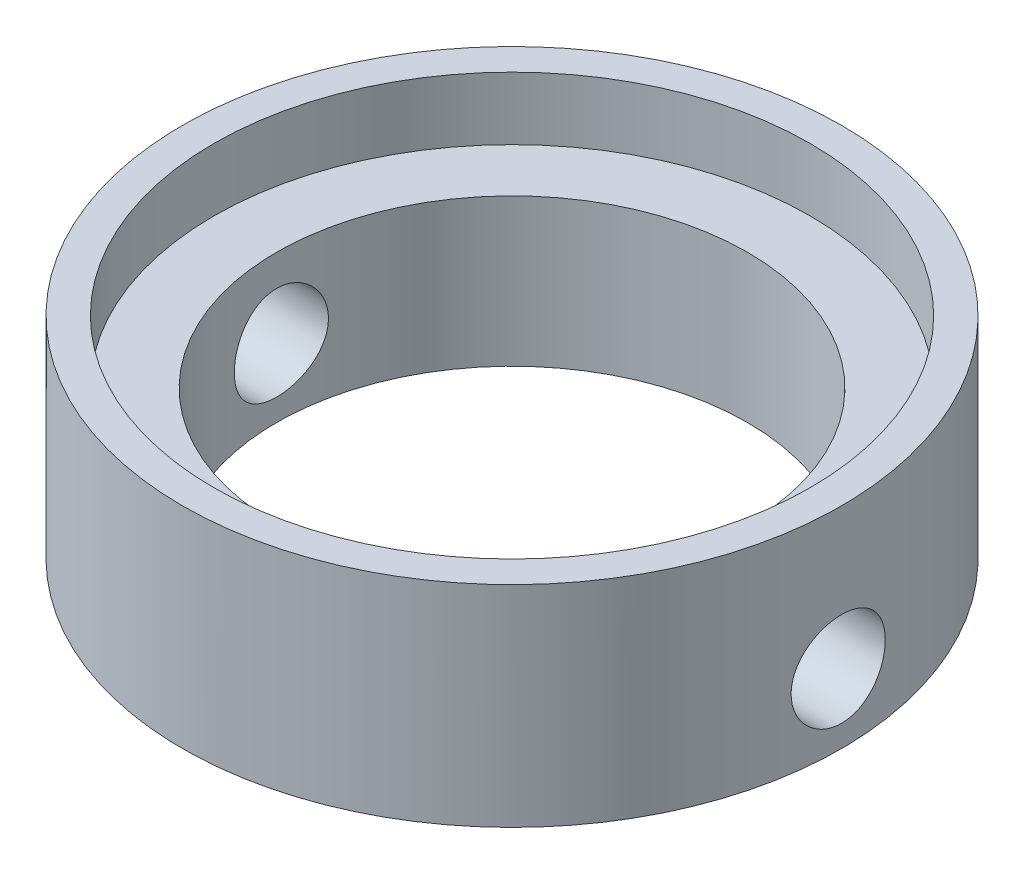
ISO-10303-21;
HEADER;
FILE_DESCRIPTION(('STEP AP214'),'2;1');
FILE_NAME('part.step','',(''),(''),'','','');
FILE_SCHEMA(('AUTOMOTIVE_DESIGN { 1 0 10303 214 1 1 1 1 }'));
ENDSEC;
DATA;
#1=APPLICATION_CONTEXT('core data for automotive mechanical design processes');
#2=APPLICATION_PROTOCOL_DEFINITION('international standard','automotive_design',2000,#1);
#3=PRODUCT_CONTEXT('',#1,'mechanical');
#4=PRODUCT('Part','Part','',(#3));
#5=PRODUCT_RELATED_PRODUCT_CATEGORY('part','',(#4));
#6=PRODUCT_DEFINITION_FORMATION('','',#4);
#7=PRODUCT_DEFINITION_CONTEXT('part definition',#1,'design');
#8=PRODUCT_DEFINITION('design','',#6,#7);
#9=PRODUCT_DEFINITION_SHAPE('','',#8);
#10=(LENGTH_UNIT() NAMED_UNIT(*) SI_UNIT(.MILLI.,.METRE.));
#11=(NAMED_UNIT(*) PLANE_ANGLE_UNIT() SI_UNIT($,.RADIAN.));
#12=(NAMED_UNIT(*) SI_UNIT($,.STERADIAN.) SOLID_ANGLE_UNIT());
#13=UNCERTAINTY_MEASURE_WITH_UNIT(LENGTH_MEASURE(1.E-05),#10,'distance_accuracy_value','');
#14=(GEOMETRIC_REPRESENTATION_CONTEXT(3) GLOBAL_UNCERTAINTY_ASSIGNED_CONTEXT((#13)) GLOBAL_UNIT_ASSIGNED_CONTEXT((#10,
#11,#12)) REPRESENTATION_CONTEXT('',''));
#15=CARTESIAN_POINT('',(0.,0.,0.));
#16=DIRECTION('',(0.,0.,1.));
#17=DIRECTION('',(1.,0.,0.));
#18=AXIS2_PLACEMENT_3D('',#15,#16,#17);
#19=CARTESIAN_POINT('',(0.,7.,0.));
#20=DIRECTION('',(0.,-1.,0.));
#21=DIRECTION('',(0.,0.,-1.));
#22=AXIS2_PLACEMENT_3D('',#19,#20,#21);
#23=CYLINDRICAL_SURFACE('',#22,10.5);
#24=CARTESIAN_POINT('',(0.,7.,0.));
#25=DIRECTION('',(0.,1.,0.));
#26=DIRECTION('',(0.,0.,1.));
#27=AXIS2_PLACEMENT_3D('',#24,#25,#26);
#28=CIRCLE('',#27,10.5);
#29=CARTESIAN_POINT('',(0.,7.,10.5));
#30=VERTEX_POINT('',#29);
#31=EDGE_CURVE('E10',#30,#30,#28,.T.);
#32=ORIENTED_EDGE('',*,*,#31,.F.);
#33=EDGE_LOOP('',(#32));
#34=FACE_BOUND('',#33,.T.);
#35=CARTESIAN_POINT('',(10.3923048454133,2.5,-1.5));
#36=CARTESIAN_POINT('',(10.3923061930305,2.41620687157653,-1.49999650587036));
#37=CARTESIAN_POINT('',(10.3933292406285,2.33236396544112,-1.49295498380541));
#38=CARTESIAN_POINT('',(10.3973084943365,2.1670190227015,-1.46498055103788));
#39=CARTESIAN_POINT('',(10.4002666268522,2.08551940336741,-1.44403379716319));
#40=CARTESIAN_POINT('',(10.4077743195951,1.92727847497168,-1.38888554127209));
#41=CARTESIAN_POINT('',(10.4123227012455,1.85053369142282,-1.35469385341522));
#42=CARTESIAN_POINT('',(10.4224969995472,1.70388270290075,-1.27404881916946));
#43=CARTESIAN_POINT('',(10.4281227569753,1.63397548972026,-1.22759728425554));
#44=CARTESIAN_POINT('',(10.4398636894,1.50246377811402,-1.12339010130137));
#45=CARTESIAN_POINT('',(10.445981808541,1.44091621460046,-1.06556292320494));
#46=CARTESIAN_POINT('',(10.4579917733928,1.32836383206969,-0.940400309225388));
#47=CARTESIAN_POINT('',(10.4638836070179,1.27735957551983,-0.873064366388353));
#48=CARTESIAN_POINT('',(10.4748077776705,1.1871331766802,-0.730432788015362));
#49=CARTESIAN_POINT('',(10.4798362672007,1.14796321411117,-0.655103824662068));
#50=CARTESIAN_POINT('',(10.4884346358971,1.08285194850414,-0.498852559472325));
#51=CARTESIAN_POINT('',(10.4920045851274,1.05691001001446,-0.417930526529498));
#52=CARTESIAN_POINT('',(10.4972628750673,1.0191630947768,-0.253375547655713));
#53=CARTESIAN_POINT('',(10.4989638773858,1.00726294752532,-0.169764843802409));
#54=CARTESIAN_POINT('',(10.5003359661287,0.997642076075051,-0.00171717395879946));
#55=CARTESIAN_POINT('',(10.5000071553917,0.999920633525417,0.0827197499554341));
#56=CARTESIAN_POINT('',(10.4973668209745,1.01851703366186,0.249374244139403));
#57=CARTESIAN_POINT('',(10.4950697559932,1.03473249916188,0.331603499828276));
#58=CARTESIAN_POINT('',(10.4887671405948,1.08058191977441,0.492161696346521));
#59=CARTESIAN_POINT('',(10.4847615495802,1.11021619374085,0.570490544446413));
#60=CARTESIAN_POINT('',(10.4754670527824,1.18216805858768,0.721336475075803));
#61=CARTESIAN_POINT('',(10.4701737612878,1.22452911333913,0.793832544593301));
#62=CARTESIAN_POINT('',(10.4588945002217,1.3207003695552,0.930725865103234));
#63=CARTESIAN_POINT('',(10.4529084892496,1.37451125548241,0.995122631558872));
#64=CARTESIAN_POINT('',(10.4408490370785,1.49262595125699,1.1145922432979));
#65=CARTESIAN_POINT('',(10.4347752923342,1.55701909956189,1.16957676999138));
#66=CARTESIAN_POINT('',(10.4232772040675,1.69416589107211,1.26797242192592));
#67=CARTESIAN_POINT('',(10.4178528638723,1.76691957710921,1.31138348787134));
#68=CARTESIAN_POINT('',(10.4082679026219,1.91881021742963,1.38540976140596));
#69=CARTESIAN_POINT('',(10.404108118274,1.99795135441195,1.41601650188834));
#70=CARTESIAN_POINT('',(10.3975384935671,2.16032318486941,1.4634796778124));
#71=CARTESIAN_POINT('',(10.395128541871,2.24355361779367,1.48033698810227));
#72=CARTESIAN_POINT('',(10.3923523556799,2.41095740307253,1.49970293016145));
#73=CARTESIAN_POINT('',(10.3919683290233,2.49511601949669,1.50233648328354));
#74=CARTESIAN_POINT('',(10.3932402939954,2.66267335376886,1.4935110618534));
#75=CARTESIAN_POINT('',(10.3948962283973,2.74607209286747,1.48205248262528));
#76=CARTESIAN_POINT('',(10.4000452239387,2.90935913502133,1.44547378391401));
#77=CARTESIAN_POINT('',(10.4035299850894,2.98926154529901,1.42041536883315));
#78=CARTESIAN_POINT('',(10.4119371840913,3.14373159809237,1.35741229628598));
#79=CARTESIAN_POINT('',(10.4168596868221,3.21829899967129,1.31946705727606));
#80=CARTESIAN_POINT('',(10.4276298631006,3.36054390979112,1.23146520248419));
#81=CARTESIAN_POINT('',(10.4334836433923,3.42817072090927,1.18132740020344));
#82=CARTESIAN_POINT('',(10.4454381814944,3.55409479271913,1.07047708366024));
#83=CARTESIAN_POINT('',(10.4515389519221,3.61239157604434,1.00976402865162));
#84=CARTESIAN_POINT('',(10.4633553931043,3.71844641382535,0.878937814714015));
#85=CARTESIAN_POINT('',(10.4690678217139,3.76612189173964,0.808757379093247));
#86=CARTESIAN_POINT('',(10.4794141616985,3.84900667235179,0.661311528578396));
#87=CARTESIAN_POINT('',(10.4840481003037,3.88421628980346,0.584046292632342));
#88=CARTESIAN_POINT('',(10.4917010838333,3.94103658573679,0.424886943445449));
#89=CARTESIAN_POINT('',(10.4947255774292,3.96269319147062,0.343009499342947));
#90=CARTESIAN_POINT('',(10.4988416933739,3.99194160032996,0.176733944284339));
#91=CARTESIAN_POINT('',(10.4999334310143,3.99953424239039,0.0923359839857093));
#92=CARTESIAN_POINT('',(10.5000600575394,4.00042017920835,-0.0757823479703668));
#93=CARTESIAN_POINT('',(10.499113162668,3.99384011426383,-0.159502066312937));
#94=CARTESIAN_POINT('',(10.4953054820628,3.96683788746773,-0.324631975109903));
#95=CARTESIAN_POINT('',(10.4924447008478,3.9464157582971,-0.406042171016581));
#96=CARTESIAN_POINT('',(10.4851291654069,3.89235251692885,-0.564212785872937));
#97=CARTESIAN_POINT('',(10.4806753711475,3.85871936463645,-0.640975972655238));
#98=CARTESIAN_POINT('',(10.4706642007672,3.77920213809848,-0.787789279388611));
#99=CARTESIAN_POINT('',(10.4651067955828,3.73331774120642,-0.857839222474913));
#100=CARTESIAN_POINT('',(10.453447855976,3.63013921358247,-0.989881462201987));
#101=CARTESIAN_POINT('',(10.447342093943,3.57275131987563,-1.05180012473989));
#102=CARTESIAN_POINT('',(10.4353066756963,3.44839182982352,-1.16517537545432));
#103=CARTESIAN_POINT('',(10.4293770612369,3.38141798275258,-1.21662949973047));
#104=CARTESIAN_POINT('',(10.4183331588892,3.23939092124829,-1.30784642606695));
#105=CARTESIAN_POINT('',(10.4132231552088,3.16429848219173,-1.34754865725748));
#106=CARTESIAN_POINT('',(10.4044472110153,3.00847577754654,-1.4137192688032));
#107=CARTESIAN_POINT('',(10.4007797507702,2.92775155126185,-1.44020158441601));
#108=CARTESIAN_POINT('',(10.3961646916439,2.78887268062728,-1.47306941374186));
#109=CARTESIAN_POINT('',(10.3947247799554,2.73158174844265,-1.48315321897163));
#110=CARTESIAN_POINT('',(10.3927943948374,2.61620185227505,-1.49661968631394));
#111=CARTESIAN_POINT('',(10.3923039108027,2.5581128972133,-1.50000242327743));
#112=CARTESIAN_POINT('',(10.3923048454133,2.5,-1.5));
#113=B_SPLINE_CURVE_WITH_KNOTS('',3,(#35,#36,#37,#38,#39,#40,#41,#42,#43,#44,#45,#46,#47,#48,
#49,#50,#51,#52,#53,#54,#55,#56,#57,#58,#59,#60,#61,#62,#63,#64,#65,#66,#67,#68,#69,#70,#71,#72,
#73,#74,#75,#76,#77,#78,#79,#80,#81,#82,#83,#84,#85,#86,#87,#88,#89,#90,#91,#92,#93,#94,#95,#96,
#97,#98,#99,#100,#101,#102,#103,#104,#105,#106,#107,#108,#109,#110,#111,#112),.UNSPECIFIED.,.T.,
.F.,(4,2,2,2,2,2,2,2,2,2,2,2,2,2,2,2,2,2,2,2,2,2,2,2,2,2,2,2,2,2,2,2,2,2,2,2,2,2,4),(0.,
0.251167012046919,0.50258444587566,0.753815941026137,1.00501033579326,1.2578378673486,
1.51067888333998,1.76461898005097,2.0185468767636,2.27074366602058,2.52292767806669,
2.77327488678676,3.02362804449878,3.27484610729135,3.52607919193874,3.77955388487777,
4.03302987644803,4.28667321996397,4.54030042341251,4.79169645810015,5.04308544058024,
5.29334325601319,5.54361236632939,5.79559590756692,6.04759233730545,6.3014844113972,
6.55537007444338,6.80839066602276,7.06139616408721,7.31215031476144,7.5629038734102,
7.81350657921438,8.06411588549586,8.31685761979592,8.56965879401817,8.82374111633996,
9.07755503914768,9.2517483897201,9.42593979454137),.UNSPECIFIED.);
#114=CARTESIAN_POINT('',(10.3923048454133,2.5,-1.5));
#115=VERTEX_POINT('',#114);
#116=EDGE_CURVE('E76',#115,#115,#113,.T.);
#117=ORIENTED_EDGE('',*,*,#116,.T.);
#118=EDGE_LOOP('',(#117));
#119=FACE_BOUND('',#118,.T.);
#120=CARTESIAN_POINT('',(-10.5,1.,0.));
#121=CARTESIAN_POINT('',(-10.4999987028432,1.00000348988322,-0.0837980470596159));
#122=CARTESIAN_POINT('',(-10.4989863030044,1.0070458107391,-0.167645858243275));
#123=CARTESIAN_POINT('',(-10.4950450575882,1.03502370435099,-0.333000990552121));
#124=CARTESIAN_POINT('',(-10.4921143049446,1.05597310265557,-0.414505898300218));
#125=CARTESIAN_POINT('',(-10.4846659524273,1.11112909260134,-0.572758015178163));
#126=CARTESIAN_POINT('',(-10.4801495125244,1.14532599523976,-0.649508654024656));
#127=CARTESIAN_POINT('',(-10.4700298362088,1.22598331434303,-0.796169475360476));
#128=CARTESIAN_POINT('',(-10.4644267614753,1.27244190677437,-0.866080673157975));
#129=CARTESIAN_POINT('',(-10.4527130868134,1.3766562567509,-0.997587975595968));
#130=CARTESIAN_POINT('',(-10.4465994865122,1.43448196428687,-1.05912838620098));
#131=CARTESIAN_POINT('',(-10.4345774973183,1.55963862180948,-1.17166693765294));
#132=CARTESIAN_POINT('',(-10.4286691198171,1.62697009839478,-1.22266449406305));
#133=CARTESIAN_POINT('',(-10.4176973473603,1.76959767408063,-1.31288381463334));
#134=CARTESIAN_POINT('',(-10.4126378279944,1.84492786942773,-1.35205218821083));
#135=CARTESIAN_POINT('',(-10.4039772398443,2.00118180923658,-1.41716017750215));
#136=CARTESIAN_POINT('',(-10.4003760990032,2.08210527710999,-1.44310044681747));
#137=CARTESIAN_POINT('',(-10.3950692906489,2.24666501474203,-1.48084398009175));
#138=CARTESIAN_POINT('',(-10.393350892854,2.33027907989174,-1.49274223279193));
#139=CARTESIAN_POINT('',(-10.3919654076813,2.4983333581522,-1.50235815011353));
#140=CARTESIAN_POINT('',(-10.3922982133056,2.58277352794108,-1.50007655440469));
#141=CARTESIAN_POINT('',(-10.3949658865654,2.74941481799961,-1.48147527146911));
#142=CARTESIAN_POINT('',(-10.3972857165318,2.83162798306878,-1.46526102269474));
#143=CARTESIAN_POINT('',(-10.4036425753426,2.99215462942639,-1.41941958482143));
#144=CARTESIAN_POINT('',(-10.4076796486131,3.07046800976675,-1.38979204871222));
#145=CARTESIAN_POINT('',(-10.4170328660292,3.22129490966264,-1.3178542818743));
#146=CARTESIAN_POINT('',(-10.4223535362188,3.2937866685787,-1.27549903967451));
#147=CARTESIAN_POINT('',(-10.433671108351,3.43067381828395,-1.17934026858057));
#148=CARTESIAN_POINT('',(-10.4396680505927,3.49506872609491,-1.12553605726883));
#149=CARTESIAN_POINT('',(-10.4517290352068,3.61454560467195,-1.00742618807158));
#150=CARTESIAN_POINT('',(-10.457793193268,3.66953791758994,-0.943029806366413));
#151=CARTESIAN_POINT('',(-10.4692547684339,3.76794775183489,-0.805873739101333));
#152=CARTESIAN_POINT('',(-10.4746521830884,3.81136523062595,-0.733114022808734));
#153=CARTESIAN_POINT('',(-10.484177029702,3.88539615624894,-0.581221559720765));
#154=CARTESIAN_POINT('',(-10.4883038145903,3.9160030821207,-0.502085591600481));
#155=CARTESIAN_POINT('',(-10.4948168991903,3.96346820397962,-0.339725024065646));
#156=CARTESIAN_POINT('',(-10.4972033055324,3.98032724228636,-0.256500675473461));
#157=CARTESIAN_POINT('',(-10.4999527092955,3.99969972011532,-0.0891000167924589));
#158=CARTESIAN_POINT('',(-10.5003331021836,4.00233649485137,-0.00493825465679325));
#159=CARTESIAN_POINT('',(-10.4990748545078,3.99351639398493,0.162626137734971));
#160=CARTESIAN_POINT('',(-10.4974362704799,3.98205991302618,0.246028789182044));
#161=CARTESIAN_POINT('',(-10.4923349529923,3.94548104380396,0.409336813488366));
#162=CARTESIAN_POINT('',(-10.4888801904757,3.92041835561533,0.489255828690092));
#163=CARTESIAN_POINT('',(-10.4805328070432,3.85740119552844,0.643757208018512));
#164=CARTESIAN_POINT('',(-10.4756401241147,3.81944616761565,0.718339341810811));
#165=CARTESIAN_POINT('',(-10.464917828782,3.7314296372594,0.860594771848394));
#166=CARTESIAN_POINT('',(-10.4590822113691,3.68128942772091,0.928218909523478));
#167=CARTESIAN_POINT('',(-10.4471433482308,3.5704359429608,1.05413647110365));
#168=CARTESIAN_POINT('',(-10.4410400884811,3.5097221131865,1.11242940530894));
#169=CARTESIAN_POINT('',(-10.4291991012728,3.37889747427665,1.21847523465575));
#170=CARTESIAN_POINT('',(-10.4234644616138,3.30871954727461,1.26614572563628));
#171=CARTESIAN_POINT('',(-10.4130635361061,3.161280110047,1.34902176565436));
#172=CARTESIAN_POINT('',(-10.4083972235518,3.08401877695629,1.38422762628812));
#173=CARTESIAN_POINT('',(-10.4006832769632,2.92485752162028,1.441045580689));
#174=CARTESIAN_POINT('',(-10.3976303728443,2.84297368086902,1.46270197598978));
#175=CARTESIAN_POINT('',(-10.3934745694833,2.67668457920829,1.49194779900115));
#176=CARTESIAN_POINT('',(-10.3923715491215,2.59227947524174,1.49953810044764));
#177=CARTESIAN_POINT('',(-10.3922446330881,2.42416463010903,1.50041692780658));
#178=CARTESIAN_POINT('',(-10.3932019074238,2.34045555125852,1.49383498025855));
#179=CARTESIAN_POINT('',(-10.3970469315899,2.17534740695615,1.466832718881));
#180=CARTESIAN_POINT('',(-10.399934679431,2.09394833912423,1.44641241931013));
#181=CARTESIAN_POINT('',(-10.4073089210813,1.93580105116661,1.39235734174347));
#182=CARTESIAN_POINT('',(-10.4117944216327,1.85904997617772,1.35873077221951));
#183=CARTESIAN_POINT('',(-10.4218600929554,1.71225816628494,1.27923048152316));
#184=CARTESIAN_POINT('',(-10.4274402937947,1.64221761577646,1.2333564239388));
#185=CARTESIAN_POINT('',(-10.4391274698967,1.51017563610332,1.13018960597321));
#186=CARTESIAN_POINT('',(-10.4452386169774,1.44824969109832,1.07280069705274));
#187=CARTESIAN_POINT('',(-10.4572636654055,1.33486021942583,0.948436134990864));
#188=CARTESIAN_POINT('',(-10.4631775204,1.28339913715863,0.881458248251206));
#189=CARTESIAN_POINT('',(-10.4741749686942,1.19217432097289,0.739427568400385));
#190=CARTESIAN_POINT('',(-10.4792542883965,1.15247000938158,0.664336288090723));
#191=CARTESIAN_POINT('',(-10.4879681705616,1.08629519199543,0.508515966277528));
#192=CARTESIAN_POINT('',(-10.4916042510231,1.05981077392571,0.427792953899236));
#193=CARTESIAN_POINT('',(-10.4961777225379,1.02693730981553,0.288908522998168));
#194=CARTESIAN_POINT('',(-10.4976038314235,1.01685097229632,0.231610424383929));
#195=CARTESIAN_POINT('',(-10.4995154149334,1.00338114318385,0.116216191024247));
#196=CARTESIAN_POINT('',(-10.5000008996729,0.999997579511146,0.0581200648672959));
#197=CARTESIAN_POINT('',(-10.5,1.,0.));
#198=B_SPLINE_CURVE_WITH_KNOTS('',3,(#120,#121,#122,#123,#124,#125,#126,#127,#128,#129,#130,
#131,#132,#133,#134,#135,#136,#137,#138,#139,#140,#141,#142,#143,#144,#145,#146,#147,#148,#149,
#150,#151,#152,#153,#154,#155,#156,#157,#158,#159,#160,#161,#162,#163,#164,#165,#166,#167,#168,
#169,#170,#171,#172,#173,#174,#175,#176,#177,#178,#179,#180,#181,#182,#183,#184,#185,#186,#187,
#188,#189,#190,#191,#192,#193,#194,#195,#196,#197),.UNSPECIFIED.,.T.,.F.,(4,2,2,2,2,2,2,2,2,2,2,
2,2,2,2,2,2,2,2,2,2,2,2,2,2,2,2,2,2,2,2,2,2,2,2,2,2,2,4),(0.,0.251181790014658,
0.502613663993753,0.753861991045278,1.00507296375776,1.2578811514321,1.51070334962241,
1.76465016063837,2.01858442290987,2.27079088981466,2.52298420087169,2.77328562434791,
3.02359352365118,3.27479726716424,3.52601598791197,3.77951067530022,4.03300629423345,
4.28663079365746,4.54023975258936,4.79164584064564,5.04304488891045,5.29334968302705,
5.54366527353743,5.79564281989972,6.04763358566374,6.30151593543519,6.5553919380977,
6.80843346555637,7.06145927444514,7.31218238885341,7.5629052449241,7.81347250803813,
8.06404665440029,8.31680735632106,8.56962703086835,8.82370353749484,9.07751209384601,
9.2517268808682,9.42593979443109),.UNSPECIFIED.);
#199=CARTESIAN_POINT('',(-10.5,1.,0.));
#200=VERTEX_POINT('',#199);
#201=EDGE_CURVE('E81',#200,#200,#198,.T.);
#202=ORIENTED_EDGE('',*,*,#201,.T.);
#203=EDGE_LOOP('',(#202));
#204=FACE_BOUND('',#203,.T.);
#205=CARTESIAN_POINT('',(0.,0.3,0.));
#206=DIRECTION('',(0.,-1.,0.));
#207=DIRECTION('',(0.,0.,-1.));
#208=AXIS2_PLACEMENT_3D('',#205,#206,#207);
#209=CIRCLE('',#208,10.5);
#210=CARTESIAN_POINT('',(0.,0.3,-10.5));
#211=VERTEX_POINT('',#210);
#212=EDGE_CURVE('E82',#211,#211,#209,.T.);
#213=ORIENTED_EDGE('',*,*,#212,.F.);
#214=EDGE_LOOP('',(#213));
#215=FACE_BOUND('',#214,.T.);
#216=ADVANCED_FACE('F35',(#34,#119,#204,#215),#23,.T.);
#217=CARTESIAN_POINT('',(0.,0.,0.));
#218=DIRECTION('',(0.,1.,0.));
#219=DIRECTION('',(0.,0.,1.));
#220=AXIS2_PLACEMENT_3D('',#217,#218,#219);
#221=CYLINDRICAL_SURFACE('',#220,7.5);
#222=CARTESIAN_POINT('',(0.,5.,0.));
#223=DIRECTION('',(0.,1.,0.));
#224=DIRECTION('',(0.,0.,1.));
#225=AXIS2_PLACEMENT_3D('',#222,#223,#224);
#226=CIRCLE('',#225,7.5);
#227=CARTESIAN_POINT('',(0.,5.,7.5));
#228=VERTEX_POINT('',#227);
#229=EDGE_CURVE('E87',#228,#228,#226,.T.);
#230=ORIENTED_EDGE('',*,*,#229,.T.);
#231=EDGE_LOOP('',(#230));
#232=FACE_BOUND('',#231,.T.);
#233=CARTESIAN_POINT('',(7.34846922834953,2.5,-1.5));
#234=CARTESIAN_POINT('',(7.34847088538349,2.58334656323576,-1.49999691881235));
#235=CARTESIAN_POINT('',(7.34990262402618,2.66673193499975,-1.49302975757707));
#236=CARTESIAN_POINT('',(7.35546646957747,2.83114375771496,-1.46536842537441));
#237=CARTESIAN_POINT('',(7.35960073717297,2.91216826695404,-1.44466327060578));
#238=CARTESIAN_POINT('',(7.37008310582665,3.06945595503125,-1.39019367392958));
#239=CARTESIAN_POINT('',(7.37642900431582,3.14572378229886,-1.35644222122892));
#240=CARTESIAN_POINT('',(7.39061699221019,3.29151226704545,-1.27687366150577));
#241=CARTESIAN_POINT('',(7.398458998102,3.36103330080686,-1.23105722790173));
#242=CARTESIAN_POINT('',(7.4148794954137,3.49234150578079,-1.12796861348015));
#243=CARTESIAN_POINT('',(7.42346606755867,3.55401938182596,-1.07055848386998));
#244=CARTESIAN_POINT('',(7.440337084539,3.66693630036847,-0.946210183531967));
#245=CARTESIAN_POINT('',(7.44862150816248,3.71817461112579,-0.879271345466978));
#246=CARTESIAN_POINT('',(7.46404194626342,3.80918202644269,-0.737042033886384));
#247=CARTESIAN_POINT('',(7.47116732162326,3.84884727072496,-0.661683851508317));
#248=CARTESIAN_POINT('',(7.48337605325447,3.9149124055722,-0.505206225580908));
#249=CARTESIAN_POINT('',(7.48845960066179,3.94131353785148,-0.424087322130831));
#250=CARTESIAN_POINT('',(7.49595481032628,3.97976079042944,-0.259525159917743));
#251=CARTESIAN_POINT('',(7.4984007943219,3.99199146635651,-0.176126608822222));
#252=CARTESIAN_POINT('',(7.50046381775405,4.00232642775747,-0.0084278526563057));
#253=CARTESIAN_POINT('',(7.50008112979138,4.00043207446873,0.0758722647477635));
#254=CARTESIAN_POINT('',(7.49655652302773,3.98271072967667,0.241713001115382));
#255=CARTESIAN_POINT('',(7.49345397548757,3.96708253424823,0.323275821447704));
#256=CARTESIAN_POINT('',(7.48488265739113,3.92265245131166,0.482597439870451));
#257=CARTESIAN_POINT('',(7.47941379216059,3.89385003671219,0.560356085620693));
#258=CARTESIAN_POINT('',(7.46665944029938,3.8237049397791,0.71042919480133));
#259=CARTESIAN_POINT('',(7.45936272262835,3.78228437334267,0.782706261200849));
#260=CARTESIAN_POINT('',(7.44375704210678,3.6881363841451,0.919357568789633));
#261=CARTESIAN_POINT('',(7.43544796282833,3.63540766034423,0.983730899287501));
#262=CARTESIAN_POINT('',(7.41856446546689,3.51904956683729,1.10392714658019));
#263=CARTESIAN_POINT('',(7.40998794686274,3.45524621990561,1.15958147486045));
#264=CARTESIAN_POINT('',(7.39367357398141,3.31912533632387,1.25942773976521));
#265=CARTESIAN_POINT('',(7.38593573556822,3.24680763867521,1.30361945959163));
#266=CARTESIAN_POINT('',(7.37217071209385,3.09546875226729,1.37934422220282));
#267=CARTESIAN_POINT('',(7.36614722345324,3.01643354854051,1.41084997166656));
#268=CARTESIAN_POINT('',(7.35654714481909,2.85404301441401,1.46008551244137));
#269=CARTESIAN_POINT('',(7.35297023592642,2.77068824857137,1.47781709918496));
#270=CARTESIAN_POINT('',(7.34873218901742,2.60355271300143,1.49874900905408));
#271=CARTESIAN_POINT('',(7.34802220585731,2.51980363853449,1.50219278834687));
#272=CARTESIAN_POINT('',(7.34946728533281,2.35292766520047,1.49510644246611));
#273=CARTESIAN_POINT('',(7.35162218550582,2.26980073132171,1.48457710968366));
#274=CARTESIAN_POINT('',(7.35850848742372,2.10734703956165,1.45005331211124));
#275=CARTESIAN_POINT('',(7.36321498521745,2.02799148544636,1.42618893125895));
#276=CARTESIAN_POINT('',(7.37465234027497,1.87440508145689,1.36581155296278));
#277=CARTESIAN_POINT('',(7.38138336429404,1.80017465434642,1.32929751355977));
#278=CARTESIAN_POINT('',(7.39622108943059,1.65788033507476,1.2441062133234));
#279=CARTESIAN_POINT('',(7.40434457797355,1.58990943054876,1.19527661697413));
#280=CARTESIAN_POINT('',(7.42100585739955,1.46303753199863,1.08704335831907));
#281=CARTESIAN_POINT('',(7.42954369085727,1.40413747262612,1.02763860771681));
#282=CARTESIAN_POINT('',(7.44623018803823,1.29615616122164,0.898848410246837));
#283=CARTESIAN_POINT('',(7.45437086563026,1.24723951802501,0.829323748394446));
#284=CARTESIAN_POINT('',(7.4692069144293,1.16178117775063,0.682901844952134));
#285=CARTESIAN_POINT('',(7.47590234632816,1.12523896098283,0.606004913150262));
#286=CARTESIAN_POINT('',(7.487059410916,1.06580669238005,0.44745402123602));
#287=CARTESIAN_POINT('',(7.49153368713906,1.04283922266062,0.365830010217118));
#288=CARTESIAN_POINT('',(7.4977985390649,1.01096312850423,0.19978418201987));
#289=CARTESIAN_POINT('',(7.49958943799765,1.00205281078648,0.115362703066822));
#290=CARTESIAN_POINT('',(7.50027810681181,0.99860952855567,-0.0523093408554337));
#291=CARTESIAN_POINT('',(7.49922567824026,1.00382907931568,-0.135554718212252));
#292=CARTESIAN_POINT('',(7.49445065340477,1.02795092582172,-0.299956546973461));
#293=CARTESIAN_POINT('',(7.49072809071528,1.04685304952211,-0.381113024630536));
#294=CARTESIAN_POINT('',(7.481032475475,1.09769348813747,-0.538879124617643));
#295=CARTESIAN_POINT('',(7.47506455871866,1.12960206719678,-0.61549866486042));
#296=CARTESIAN_POINT('',(7.46152083185077,1.20551836199635,-0.762331830278928));
#297=CARTESIAN_POINT('',(7.45394489468828,1.24952703385557,-0.832544948651117));
#298=CARTESIAN_POINT('',(7.43786398736791,1.34922908059312,-0.965795835159535));
#299=CARTESIAN_POINT('',(7.4293460013317,1.40509950458016,-1.02869957417475));
#300=CARTESIAN_POINT('',(7.41241834355477,1.52657536014365,-1.14432392663527));
#301=CARTESIAN_POINT('',(7.40400869794476,1.59218309420307,-1.19704212480408));
#302=CARTESIAN_POINT('',(7.3881501412478,1.7321189750503,-1.29133832918279));
#303=CARTESIAN_POINT('',(7.38071255446371,1.80653344174069,-1.33279022195961));
#304=CARTESIAN_POINT('',(7.36777855777287,1.9613991599494,-1.40253607393175));
#305=CARTESIAN_POINT('',(7.36228038807748,2.04184485804634,-1.43084196896908));
#306=CARTESIAN_POINT('',(7.3549452169166,2.18539368315525,-1.4680037097813));
#307=CARTESIAN_POINT('',(7.35253177367824,2.24767812926849,-1.47998084778413));
#308=CARTESIAN_POINT('',(7.34929317692711,2.37330093182915,-1.49598002694097));
#309=CARTESIAN_POINT('',(7.34846796865858,2.43663925186744,-1.50000234234439));
#310=CARTESIAN_POINT('',(7.34846922834953,2.5,-1.5));
#311=B_SPLINE_CURVE_WITH_KNOTS('',3,(#233,#234,#235,#236,#237,#238,#239,#240,#241,#242,#243,
#244,#245,#246,#247,#248,#249,#250,#251,#252,#253,#254,#255,#256,#257,#258,#259,#260,#261,#262,
#263,#264,#265,#266,#267,#268,#269,#270,#271,#272,#273,#274,#275,#276,#277,#278,#279,#280,#281,
#282,#283,#284,#285,#286,#287,#288,#289,#290,#291,#292,#293,#294,#295,#296,#297,#298,#299,#300,
#301,#302,#303,#304,#305,#306,#307,#308,#309,#310),.UNSPECIFIED.,.T.,.F.,(4,2,2,2,2,2,2,2,2,2,2,
2,2,2,2,2,2,2,2,2,2,2,2,2,2,2,2,2,2,2,2,2,2,2,2,2,2,2,4),(0.,0.249807695804142,
0.499815358926444,0.749574746910878,0.999320197289794,1.25223378822655,1.50516510053133,
1.76030100656175,2.01541302369839,2.2671637332462,2.51889018174372,2.76703184450306,
3.01518343610625,3.26489886333455,3.51464303655099,3.76874020143725,4.0228421718408,
4.27748794759165,4.53210052524037,4.7823563670689,5.03259801792632,5.28044012674978,
5.52830265531597,5.77939589661781,6.03051499305313,6.28548902600176,6.54045234945157,
6.79394720367975,7.04741152037442,7.29646526122029,7.54551587050135,7.79400025613178,
8.04250428202026,8.29501728038395,8.54759008334672,8.80288347868562,9.05794462633399,
9.24785705455344,9.43776293526322),.UNSPECIFIED.);
#312=CARTESIAN_POINT('',(7.34846922834953,2.5,-1.5));
#313=VERTEX_POINT('',#312);
#314=EDGE_CURVE('E52',#313,#313,#311,.T.);
#315=ORIENTED_EDGE('',*,*,#314,.T.);
#316=EDGE_LOOP('',(#315));
#317=FACE_BOUND('',#316,.T.);
#318=CARTESIAN_POINT('',(-7.34846922834954,2.5,-1.5));
#319=CARTESIAN_POINT('',(-7.3484708853835,2.41665343676424,-1.49999691881235));
#320=CARTESIAN_POINT('',(-7.34990262402619,2.33326806500025,-1.49302975757707));
#321=CARTESIAN_POINT('',(-7.35546646957746,2.16885624228504,-1.46536842537441));
#322=CARTESIAN_POINT('',(-7.35960073717297,2.08783173304596,-1.44466327060578));
#323=CARTESIAN_POINT('',(-7.37008310582665,1.93054404496875,-1.39019367392958));
#324=CARTESIAN_POINT('',(-7.37642900431582,1.85427621770113,-1.35644222122892));
#325=CARTESIAN_POINT('',(-7.39061699221019,1.70848773295455,-1.27687366150577));
#326=CARTESIAN_POINT('',(-7.398458998102,1.63896669919314,-1.23105722790173));
#327=CARTESIAN_POINT('',(-7.4148794954137,1.50765849421921,-1.12796861348015));
#328=CARTESIAN_POINT('',(-7.42346606755867,1.44598061817404,-1.07055848386998));
#329=CARTESIAN_POINT('',(-7.440337084539,1.33306369963153,-0.946210183531966));
#330=CARTESIAN_POINT('',(-7.44862150816248,1.28182538887421,-0.879271345466977));
#331=CARTESIAN_POINT('',(-7.46404194626342,1.19081797355731,-0.737042033886384));
#332=CARTESIAN_POINT('',(-7.47116732162326,1.15115272927504,-0.661683851508316));
#333=CARTESIAN_POINT('',(-7.48337605325447,1.08508759442779,-0.505206225580907));
#334=CARTESIAN_POINT('',(-7.48845960066179,1.05868646214851,-0.424087322130829));
#335=CARTESIAN_POINT('',(-7.49595481032628,1.02023920957056,-0.259525159917741));
#336=CARTESIAN_POINT('',(-7.4984007943219,1.00800853364349,-0.176126608822221));
#337=CARTESIAN_POINT('',(-7.50046381775405,0.997673572242527,-0.00842785265630416));
#338=CARTESIAN_POINT('',(-7.50008112979138,0.999567925531268,0.075872264747765));
#339=CARTESIAN_POINT('',(-7.49655652302773,1.01728927032333,0.241713001115383));
#340=CARTESIAN_POINT('',(-7.49345397548757,1.03291746575177,0.323275821447705));
#341=CARTESIAN_POINT('',(-7.48488265739113,1.07734754868834,0.482597439870452));
#342=CARTESIAN_POINT('',(-7.47941379216059,1.10614996328781,0.560356085620694));
#343=CARTESIAN_POINT('',(-7.46665944029938,1.1762950602209,0.710429194801331));
#344=CARTESIAN_POINT('',(-7.45936272262835,1.21771562665733,0.78270626120085));
#345=CARTESIAN_POINT('',(-7.44375704210678,1.3118636158549,0.919357568789634));
#346=CARTESIAN_POINT('',(-7.43544796282833,1.36459233965577,0.983730899287501));
#347=CARTESIAN_POINT('',(-7.41856446546689,1.48095043316271,1.10392714658019));
#348=CARTESIAN_POINT('',(-7.40998794686274,1.54475378009438,1.15958147486045));
#349=CARTESIAN_POINT('',(-7.39367357398141,1.68087466367613,1.25942773976521));
#350=CARTESIAN_POINT('',(-7.38593573556822,1.75319236132479,1.30361945959163));
#351=CARTESIAN_POINT('',(-7.37217071209385,1.90453124773271,1.37934422220282));
#352=CARTESIAN_POINT('',(-7.36614722345324,1.98356645145949,1.41084997166656));
#353=CARTESIAN_POINT('',(-7.35654714481909,2.14595698558599,1.46008551244137));
#354=CARTESIAN_POINT('',(-7.35297023592642,2.22931175142863,1.47781709918496));
#355=CARTESIAN_POINT('',(-7.34873218901742,2.39644728699857,1.49874900905408));
#356=CARTESIAN_POINT('',(-7.34802220585731,2.48019636146551,1.50219278834687));
#357=CARTESIAN_POINT('',(-7.34946728533281,2.64707233479952,1.49510644246611));
#358=CARTESIAN_POINT('',(-7.35162218550582,2.73019926867829,1.48457710968366));
#359=CARTESIAN_POINT('',(-7.35850848742372,2.89265296043835,1.45005331211124));
#360=CARTESIAN_POINT('',(-7.36321498521745,2.97200851455364,1.42618893125895));
#361=CARTESIAN_POINT('',(-7.37465234027497,3.12559491854311,1.36581155296278));
#362=CARTESIAN_POINT('',(-7.38138336429404,3.19982534565358,1.32929751355976));
#363=CARTESIAN_POINT('',(-7.39622108943059,3.34211966492524,1.2441062133234));
#364=CARTESIAN_POINT('',(-7.40434457797355,3.41009056945124,1.19527661697413));
#365=CARTESIAN_POINT('',(-7.42100585739955,3.53696246800137,1.08704335831907));
#366=CARTESIAN_POINT('',(-7.42954369085727,3.59586252737388,1.02763860771681));
#367=CARTESIAN_POINT('',(-7.44623018803823,3.70384383877836,0.898848410246836));
#368=CARTESIAN_POINT('',(-7.45437086563026,3.75276048197499,0.829323748394444));
#369=CARTESIAN_POINT('',(-7.4692069144293,3.83821882224938,0.682901844952132));
#370=CARTESIAN_POINT('',(-7.47590234632816,3.87476103901717,0.60600491315026));
#371=CARTESIAN_POINT('',(-7.487059410916,3.93419330761995,0.447454021236019));
#372=CARTESIAN_POINT('',(-7.49153368713906,3.95716077733938,0.365830010217117));
#373=CARTESIAN_POINT('',(-7.4977985390649,3.98903687149577,0.199784182019869));
#374=CARTESIAN_POINT('',(-7.49958943799765,3.99794718921352,0.115362703066821));
#375=CARTESIAN_POINT('',(-7.50027810681181,4.00139047144433,-0.0523093408554349));
#376=CARTESIAN_POINT('',(-7.49922567824026,3.99617092068432,-0.135554718212253));
#377=CARTESIAN_POINT('',(-7.49445065340477,3.97204907417828,-0.299956546973462));
#378=CARTESIAN_POINT('',(-7.49072809071528,3.95314695047789,-0.381113024630536));
#379=CARTESIAN_POINT('',(-7.481032475475,3.90230651186253,-0.538879124617644));
#380=CARTESIAN_POINT('',(-7.47506455871866,3.87039793280322,-0.615498664860421));
#381=CARTESIAN_POINT('',(-7.46152083185077,3.79448163800365,-0.762331830278929));
#382=CARTESIAN_POINT('',(-7.45394489468828,3.75047296614443,-0.832544948651117));
#383=CARTESIAN_POINT('',(-7.43786398736791,3.65077091940688,-0.965795835159535));
#384=CARTESIAN_POINT('',(-7.4293460013317,3.59490049541984,-1.02869957417475));
#385=CARTESIAN_POINT('',(-7.41241834355477,3.47342463985635,-1.14432392663527));
#386=CARTESIAN_POINT('',(-7.40400869794476,3.40781690579693,-1.19704212480408));
#387=CARTESIAN_POINT('',(-7.3881501412478,3.26788102494969,-1.29133832918279));
#388=CARTESIAN_POINT('',(-7.38071255446371,3.19346655825931,-1.33279022195961));
#389=CARTESIAN_POINT('',(-7.36777855777287,3.0386008400506,-1.40253607393175));
#390=CARTESIAN_POINT('',(-7.36228038807748,2.95815514195366,-1.43084196896908));
#391=CARTESIAN_POINT('',(-7.3549452169166,2.81460631684475,-1.4680037097813));
#392=CARTESIAN_POINT('',(-7.35253177367824,2.75232187073151,-1.47998084778413));
#393=CARTESIAN_POINT('',(-7.34929317692711,2.62669906817085,-1.49598002694097));
#394=CARTESIAN_POINT('',(-7.34846796865859,2.56336074813256,-1.50000234234439));
#395=CARTESIAN_POINT('',(-7.34846922834954,2.5,-1.5));
#396=B_SPLINE_CURVE_WITH_KNOTS('',3,(#318,#319,#320,#321,#322,#323,#324,#325,#326,#327,#328,
#329,#330,#331,#332,#333,#334,#335,#336,#337,#338,#339,#340,#341,#342,#343,#344,#345,#346,#347,
#348,#349,#350,#351,#352,#353,#354,#355,#356,#357,#358,#359,#360,#361,#362,#363,#364,#365,#366,
#367,#368,#369,#370,#371,#372,#373,#374,#375,#376,#377,#378,#379,#380,#381,#382,#383,#384,#385,
#386,#387,#388,#389,#390,#391,#392,#393,#394,#395),.UNSPECIFIED.,.T.,.F.,(4,2,2,2,2,2,2,2,2,2,2,
2,2,2,2,2,2,2,2,2,2,2,2,2,2,2,2,2,2,2,2,2,2,2,2,2,2,2,4),(0.,0.249807695804142,
0.499815358926445,0.749574746910879,0.999320197289796,1.25223378822655,1.50516510053133,
1.76030100656175,2.0154130236984,2.26716373324621,2.51889018174372,2.76703184450306,
3.01518343610625,3.26489886333455,3.51464303655099,3.76874020143725,4.0228421718408,
4.27748794759165,4.53210052524037,4.7823563670689,5.03259801792632,5.28044012674978,
5.52830265531598,5.77939589661782,6.03051499305313,6.28548902600176,6.54045234945157,
6.79394720367975,7.04741152037442,7.29646526122029,7.54551587050135,7.79400025613178,
8.04250428202026,8.29501728038395,8.54759008334672,8.80288347868562,9.05794462633399,
9.24785705455344,9.43776293526322),.UNSPECIFIED.);
#397=CARTESIAN_POINT('',(-7.34846922834954,2.5,-1.5));
#398=VERTEX_POINT('',#397);
#399=EDGE_CURVE('E58',#398,#398,#396,.T.);
#400=ORIENTED_EDGE('',*,*,#399,.T.);
#401=EDGE_LOOP('',(#400));
#402=FACE_BOUND('',#401,.T.);
#403=CARTESIAN_POINT('',(0.,0.3,0.));
#404=DIRECTION('',(0.,-1.,0.));
#405=DIRECTION('',(0.,0.,-1.));
#406=AXIS2_PLACEMENT_3D('',#403,#404,#405);
#407=CIRCLE('',#406,7.5);
#408=CARTESIAN_POINT('',(0.,0.3,-7.5));
#409=VERTEX_POINT('',#408);
#410=EDGE_CURVE('E39',#409,#409,#407,.F.);
#411=ORIENTED_EDGE('',*,*,#410,.F.);
#412=EDGE_LOOP('',(#411));
#413=FACE_BOUND('',#412,.T.);
#414=ADVANCED_FACE('F61',(#232,#317,#402,#413),#221,.F.);
#415=CARTESIAN_POINT('',(0.,7.,0.));
#416=DIRECTION('',(0.,1.,0.));
#417=DIRECTION('',(0.,0.,1.));
#418=AXIS2_PLACEMENT_3D('',#415,#416,#417);
#419=PLANE('',#418);
#420=CARTESIAN_POINT('',(0.,7.,0.));
#421=DIRECTION('',(0.,1.,0.));
#422=DIRECTION('',(0.,0.,1.));
#423=AXIS2_PLACEMENT_3D('',#420,#421,#422);
#424=CIRCLE('',#423,9.5);
#425=CARTESIAN_POINT('',(0.,7.,9.5));
#426=VERTEX_POINT('',#425);
#427=EDGE_CURVE('E48',#426,#426,#424,.T.);
#428=ORIENTED_EDGE('',*,*,#427,.F.);
#429=EDGE_LOOP('',(#428));
#430=FACE_BOUND('',#429,.T.);
#431=ORIENTED_EDGE('',*,*,#31,.T.);
#432=EDGE_LOOP('',(#431));
#433=FACE_BOUND('',#432,.T.);
#434=ADVANCED_FACE('F96',(#430,#433),#419,.T.);
#435=CARTESIAN_POINT('',(0.,5.,0.));
#436=DIRECTION('',(0.,1.,0.));
#437=DIRECTION('',(0.,0.,1.));
#438=AXIS2_PLACEMENT_3D('',#435,#436,#437);
#439=CYLINDRICAL_SURFACE('',#438,9.5);
#440=CARTESIAN_POINT('',(0.,5.,0.));
#441=DIRECTION('',(0.,1.,0.));
#442=DIRECTION('',(0.,0.,1.));
#443=AXIS2_PLACEMENT_3D('',#440,#441,#442);
#444=CIRCLE('',#443,9.5);
#445=CARTESIAN_POINT('',(0.,5.,9.5));
#446=VERTEX_POINT('',#445);
#447=EDGE_CURVE('E43',#446,#446,#444,.T.);
#448=ORIENTED_EDGE('',*,*,#447,.F.);
#449=EDGE_LOOP('',(#448));
#450=FACE_BOUND('',#449,.T.);
#451=ORIENTED_EDGE('',*,*,#427,.T.);
#452=EDGE_LOOP('',(#451));
#453=FACE_BOUND('',#452,.T.);
#454=ADVANCED_FACE('F94',(#450,#453),#439,.F.);
#455=CARTESIAN_POINT('',(0.,5.,0.));
#456=DIRECTION('',(0.,1.,0.));
#457=DIRECTION('',(0.,0.,1.));
#458=AXIS2_PLACEMENT_3D('',#455,#456,#457);
#459=PLANE('',#458);
#460=ORIENTED_EDGE('',*,*,#229,.F.);
#461=EDGE_LOOP('',(#460));
#462=FACE_BOUND('',#461,.T.);
#463=ORIENTED_EDGE('',*,*,#447,.T.);
#464=EDGE_LOOP('',(#463));
#465=FACE_BOUND('',#464,.T.);
#466=ADVANCED_FACE('F102',(#462,#465),#459,.T.);
#467=CARTESIAN_POINT('',(-10.5,2.5,0.));
#468=DIRECTION('',(1.,0.,0.));
#469=DIRECTION('',(0.,0.,-1.));
#470=AXIS2_PLACEMENT_3D('',#467,#468,#469);
#471=CYLINDRICAL_SURFACE('',#470,1.5);
#472=ORIENTED_EDGE('',*,*,#314,.F.);
#473=EDGE_LOOP('',(#472));
#474=FACE_BOUND('',#473,.T.);
#475=ORIENTED_EDGE('',*,*,#116,.F.);
#476=EDGE_LOOP('',(#475));
#477=FACE_BOUND('',#476,.T.);
#478=ADVANCED_FACE('F69',(#474,#477),#471,.F.);
#479=ORIENTED_EDGE('',*,*,#399,.F.);
#480=EDGE_LOOP('',(#479));
#481=FACE_BOUND('',#480,.T.);
#482=ORIENTED_EDGE('',*,*,#201,.F.);
#483=EDGE_LOOP('',(#482));
#484=FACE_BOUND('',#483,.T.);
#485=ADVANCED_FACE('F64',(#481,#484),#471,.F.);
#486=CARTESIAN_POINT('',(0.,0.3,0.));
#487=DIRECTION('',(0.,-1.,0.));
#488=DIRECTION('',(0.,0.,-1.));
#489=AXIS2_PLACEMENT_3D('',#486,#487,#488);
#490=PLANE('',#489);
#491=ORIENTED_EDGE('',*,*,#212,.T.);
#492=EDGE_LOOP('',(#491));
#493=FACE_BOUND('',#492,.T.);
#494=ORIENTED_EDGE('',*,*,#410,.T.);
#495=EDGE_LOOP('',(#494));
#496=FACE_BOUND('',#495,.T.);
#497=ADVANCED_FACE('F68',(#493,#496),#490,.T.);
#498=CLOSED_SHELL('',(#216,#414,#434,#454,#466,#478,#485,#497));
#499=MANIFOLD_SOLID_BREP('B2',#498);
#500=ADVANCED_BREP_SHAPE_REPRESENTATION('',(#18,#499),#14);
#501=SHAPE_DEFINITION_REPRESENTATION(#9,#500);
ENDSEC;
END-ISO-10303-21;
